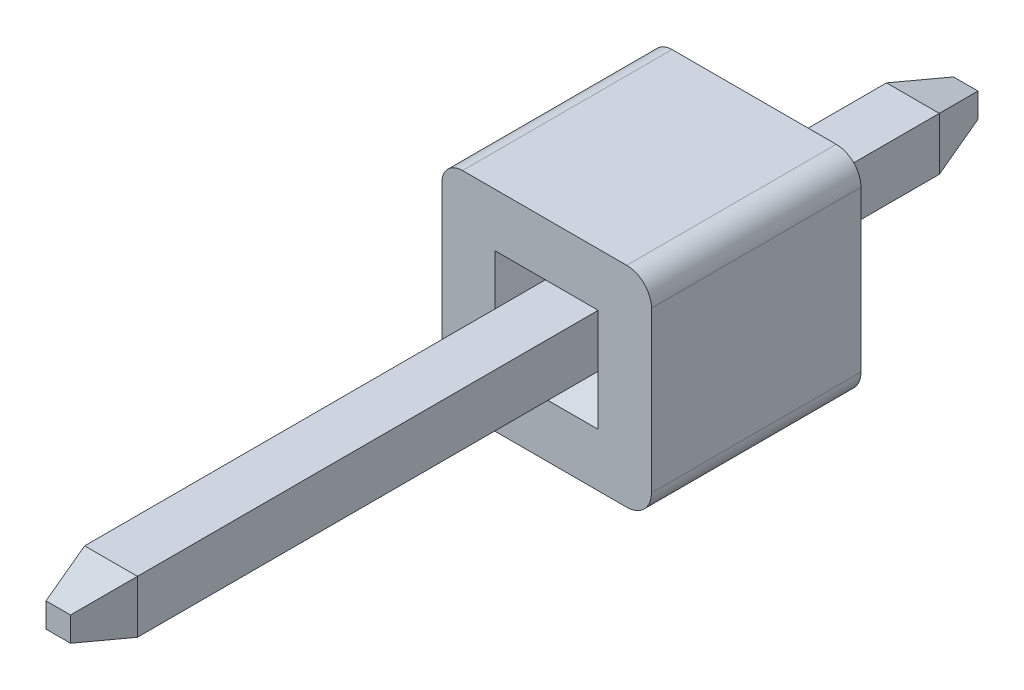
ISO-10303-21;
HEADER;
FILE_DESCRIPTION(('STEP AP214'),'2;1');
FILE_NAME('part.step','',(''),(''),'','','');
FILE_SCHEMA(('AUTOMOTIVE_DESIGN { 1 0 10303 214 1 1 1 1 }'));
ENDSEC;
DATA;
#1=APPLICATION_CONTEXT('core data for automotive mechanical design processes');
#2=APPLICATION_PROTOCOL_DEFINITION('international standard','automotive_design',2000,#1);
#3=PRODUCT_CONTEXT('',#1,'mechanical');
#4=PRODUCT('Part','Part','',(#3));
#5=PRODUCT_RELATED_PRODUCT_CATEGORY('part','',(#4));
#6=PRODUCT_DEFINITION_FORMATION('','',#4);
#7=PRODUCT_DEFINITION_CONTEXT('part definition',#1,'design');
#8=PRODUCT_DEFINITION('design','',#6,#7);
#9=PRODUCT_DEFINITION_SHAPE('','',#8);
#10=(LENGTH_UNIT() NAMED_UNIT(*) SI_UNIT(.MILLI.,.METRE.));
#11=(NAMED_UNIT(*) PLANE_ANGLE_UNIT() SI_UNIT($,.RADIAN.));
#12=(NAMED_UNIT(*) SI_UNIT($,.STERADIAN.) SOLID_ANGLE_UNIT());
#13=UNCERTAINTY_MEASURE_WITH_UNIT(LENGTH_MEASURE(1.E-05),#10,'distance_accuracy_value','');
#14=(GEOMETRIC_REPRESENTATION_CONTEXT(3) GLOBAL_UNCERTAINTY_ASSIGNED_CONTEXT((#13)) GLOBAL_UNIT_ASSIGNED_CONTEXT((#10,
#11,#12)) REPRESENTATION_CONTEXT('',''));
#15=CARTESIAN_POINT('',(0.,0.,0.));
#16=DIRECTION('',(0.,0.,1.));
#17=DIRECTION('',(1.,0.,0.));
#18=AXIS2_PLACEMENT_3D('',#15,#16,#17);
#19=CARTESIAN_POINT('',(93.9921877015739,166.440791815583,-2.54));
#20=DIRECTION('',(0.,1.,0.));
#21=DIRECTION('',(-1.,0.,0.));
#22=AXIS2_PLACEMENT_3D('',#19,#20,#21);
#23=PLANE('',#22);
#24=DIRECTION('',(-1.,0.,0.));
#25=VECTOR('',#24,1.);
#26=CARTESIAN_POINT('',(93.9921877015741,166.440791815583,0.3));
#27=LINE('',#26,#25);
#28=CARTESIAN_POINT('',(94.3171877015739,166.440791815583,0.3));
#29=VERTEX_POINT('',#28);
#30=CARTESIAN_POINT('',(93.6671877015739,166.440791815583,0.3));
#31=VERTEX_POINT('',#30);
#32=EDGE_CURVE('P0_E204',#29,#31,#27,.T.);
#33=ORIENTED_EDGE('',*,*,#32,.F.);
#34=DIRECTION('',(0.,0.,1.));
#35=VECTOR('',#34,1.);
#36=CARTESIAN_POINT('',(94.3171877015739,166.440791815583,-2.54));
#37=LINE('',#36,#35);
#38=CARTESIAN_POINT('',(94.3171877015739,166.440791815583,2.24));
#39=VERTEX_POINT('',#38);
#40=EDGE_CURVE('P0_E237',#29,#39,#37,.T.);
#41=ORIENTED_EDGE('',*,*,#40,.T.);
#42=DIRECTION('',(1.,0.,0.));
#43=VECTOR('',#42,1.);
#44=CARTESIAN_POINT('',(93.9921877015741,166.440791815583,2.24));
#45=LINE('',#44,#43);
#46=CARTESIAN_POINT('',(93.6671877015739,166.440791815583,2.24));
#47=VERTEX_POINT('',#46);
#48=EDGE_CURVE('P0_E27',#47,#39,#45,.T.);
#49=ORIENTED_EDGE('',*,*,#48,.F.);
#50=DIRECTION('',(0.,0.,1.));
#51=VECTOR('',#50,1.);
#52=CARTESIAN_POINT('',(93.6671877015739,166.440791815583,-2.54));
#53=LINE('',#52,#51);
#54=EDGE_CURVE('P0_E175',#31,#47,#53,.T.);
#55=ORIENTED_EDGE('',*,*,#54,.F.);
#56=EDGE_LOOP('',(#33,#41,#49,#55));
#57=FACE_BOUND('',#56,.T.);
#58=ADVANCED_FACE('P0_F17',(#57),#23,.F.);
#59=CARTESIAN_POINT('',(94.4671877015739,166.115791815583,2.39));
#60=DIRECTION('',(-0.707106781186548,0.,0.707106781186548));
#61=DIRECTION('',(0.707106781186548,0.,0.707106781186548));
#62=AXIS2_PLACEMENT_3D('',#59,#60,#61);
#63=PLANE('',#62);
#64=DIRECTION('',(0.,1.,0.));
#65=VECTOR('',#64,1.);
#66=CARTESIAN_POINT('',(94.6171877015739,166.115791815583,2.54));
#67=LINE('',#66,#65);
#68=CARTESIAN_POINT('',(94.6171877015739,165.490791815584,2.54));
#69=VERTEX_POINT('',#68);
#70=CARTESIAN_POINT('',(94.6171877015739,166.740791815584,2.54));
#71=VERTEX_POINT('',#70);
#72=EDGE_CURVE('P0_E200',#69,#71,#67,.T.);
#73=ORIENTED_EDGE('',*,*,#72,.T.);
#74=DIRECTION('',(0.577350269189626,0.577350269189626,0.577350269189626));
#75=VECTOR('',#74,1.);
#76=CARTESIAN_POINT('',(94.3171877015739,166.440791815583,2.24));
#77=LINE('',#76,#75);
#78=EDGE_CURVE('P0_E11',#39,#71,#77,.T.);
#79=ORIENTED_EDGE('',*,*,#78,.F.);
#80=DIRECTION('',(0.,-1.,0.));
#81=VECTOR('',#80,1.);
#82=CARTESIAN_POINT('',(94.3171877015739,166.115791815583,2.24));
#83=LINE('',#82,#81);
#84=CARTESIAN_POINT('',(94.3171877015739,165.790791815584,2.24));
#85=VERTEX_POINT('',#84);
#86=EDGE_CURVE('P0_E235',#39,#85,#83,.T.);
#87=ORIENTED_EDGE('',*,*,#86,.T.);
#88=DIRECTION('',(-0.577350269189626,0.577350269189626,-0.577350269189626));
#89=VECTOR('',#88,1.);
#90=CARTESIAN_POINT('',(94.6171877015739,165.490791815584,2.54));
#91=LINE('',#90,#89);
#92=EDGE_CURVE('P0_E223',#69,#85,#91,.T.);
#93=ORIENTED_EDGE('',*,*,#92,.F.);
#94=EDGE_LOOP('',(#73,#79,#87,#93));
#95=FACE_BOUND('',#94,.T.);
#96=ADVANCED_FACE('P0_F302',(#95),#63,.T.);
#97=CARTESIAN_POINT('',(93.9921877015741,166.590791815584,2.39));
#98=DIRECTION('',(0.,-0.707106781186548,0.707106781186548));
#99=DIRECTION('',(1.,0.,0.));
#100=AXIS2_PLACEMENT_3D('',#97,#98,#99);
#101=PLANE('',#100);
#102=DIRECTION('',(-1.,0.,0.));
#103=VECTOR('',#102,1.);
#104=CARTESIAN_POINT('',(93.9921877015741,166.740791815584,2.54));
#105=LINE('',#104,#103);
#106=CARTESIAN_POINT('',(93.3671877015739,166.740791815584,2.54));
#107=VERTEX_POINT('',#106);
#108=EDGE_CURVE('P0_E197',#71,#107,#105,.T.);
#109=ORIENTED_EDGE('',*,*,#108,.T.);
#110=DIRECTION('',(-0.577350269189626,0.577350269189626,0.577350269189626));
#111=VECTOR('',#110,1.);
#112=CARTESIAN_POINT('',(93.6671877015739,166.440791815583,2.24));
#113=LINE('',#112,#111);
#114=EDGE_CURVE('P0_E169',#47,#107,#113,.T.);
#115=ORIENTED_EDGE('',*,*,#114,.F.);
#116=ORIENTED_EDGE('',*,*,#48,.T.);
#117=ORIENTED_EDGE('',*,*,#78,.T.);
#118=EDGE_LOOP('',(#109,#115,#116,#117));
#119=FACE_BOUND('',#118,.T.);
#120=ADVANCED_FACE('P0_F366',(#119),#101,.T.);
#121=CARTESIAN_POINT('',(93.517187701574,166.115791815583,2.39));
#122=DIRECTION('',(0.707106781186548,0.,0.707106781186548));
#123=DIRECTION('',(0.707106781186548,0.,-0.707106781186548));
#124=AXIS2_PLACEMENT_3D('',#121,#122,#123);
#125=PLANE('',#124);
#126=DIRECTION('',(0.,-1.,0.));
#127=VECTOR('',#126,1.);
#128=CARTESIAN_POINT('',(93.3671877015739,166.115791815583,2.54));
#129=LINE('',#128,#127);
#130=CARTESIAN_POINT('',(93.3671877015739,165.490791815584,2.54));
#131=VERTEX_POINT('',#130);
#132=EDGE_CURVE('P0_E201',#107,#131,#129,.T.);
#133=ORIENTED_EDGE('',*,*,#132,.T.);
#134=DIRECTION('',(-0.577350269189626,-0.577350269189626,0.577350269189626));
#135=VECTOR('',#134,1.);
#136=CARTESIAN_POINT('',(93.6671877015739,165.790791815584,2.24));
#137=LINE('',#136,#135);
#138=CARTESIAN_POINT('',(93.7404110062773,165.864015120287,2.16677669529663));
#139=VERTEX_POINT('',#138);
#140=EDGE_CURVE('P0_E222',#139,#131,#137,.T.);
#141=ORIENTED_EDGE('',*,*,#140,.F.);
#142=CARTESIAN_POINT('',(93.9171877015739,166.040791815584,1.99));
#143=DIRECTION('',(0.707106781186548,0.,0.707106781186548));
#144=DIRECTION('',(-0.707106781186548,0.,0.707106781186548));
#145=AXIS2_PLACEMENT_3D('',#142,#143,#144);
#146=ELLIPSE('',#145,0.353553390593274,0.25);
#147=CARTESIAN_POINT('',(93.6671877015739,166.040791815584,2.24));
#148=VERTEX_POINT('',#147);
#149=EDGE_CURVE('P0_E218',#148,#139,#146,.T.);
#150=ORIENTED_EDGE('',*,*,#149,.F.);
#151=DIRECTION('',(0.,1.,0.));
#152=VECTOR('',#151,1.);
#153=CARTESIAN_POINT('',(93.6671877015739,166.115791815583,2.24));
#154=LINE('',#153,#152);
#155=EDGE_CURVE('P0_E183',#148,#47,#154,.T.);
#156=ORIENTED_EDGE('',*,*,#155,.T.);
#157=ORIENTED_EDGE('',*,*,#114,.T.);
#158=EDGE_LOOP('',(#133,#141,#150,#156,#157));
#159=FACE_BOUND('',#158,.T.);
#160=ADVANCED_FACE('P0_F371',(#159),#125,.T.);
#161=CARTESIAN_POINT('',(93.9921877015741,165.640791815583,2.39));
#162=DIRECTION('',(0.,0.707106781186548,0.707106781186548));
#163=DIRECTION('',(1.,0.,0.));
#164=AXIS2_PLACEMENT_3D('',#161,#162,#163);
#165=PLANE('',#164);
#166=DIRECTION('',(1.,0.,0.));
#167=VECTOR('',#166,1.);
#168=CARTESIAN_POINT('',(93.9921877015741,165.490791815584,2.54));
#169=LINE('',#168,#167);
#170=EDGE_CURVE('P0_E240',#131,#69,#169,.T.);
#171=ORIENTED_EDGE('',*,*,#170,.T.);
#172=ORIENTED_EDGE('',*,*,#92,.T.);
#173=DIRECTION('',(-1.,0.,0.));
#174=VECTOR('',#173,1.);
#175=CARTESIAN_POINT('',(93.9921877015741,165.790791815584,2.24));
#176=LINE('',#175,#174);
#177=CARTESIAN_POINT('',(93.9171877015739,165.790791815584,2.24));
#178=VERTEX_POINT('',#177);
#179=EDGE_CURVE('P0_E254',#85,#178,#176,.T.);
#180=ORIENTED_EDGE('',*,*,#179,.T.);
#181=CARTESIAN_POINT('',(93.9171877015739,166.040791815584,1.99));
#182=DIRECTION('',(0.,0.707106781186548,0.707106781186548));
#183=DIRECTION('',(0.,-0.707106781186548,0.707106781186548));
#184=AXIS2_PLACEMENT_3D('',#181,#182,#183);
#185=ELLIPSE('',#184,0.353553390593274,0.25);
#186=EDGE_CURVE('P0_E231',#139,#178,#185,.T.);
#187=ORIENTED_EDGE('',*,*,#186,.F.);
#188=ORIENTED_EDGE('',*,*,#140,.T.);
#189=EDGE_LOOP('',(#171,#172,#180,#187,#188));
#190=FACE_BOUND('',#189,.T.);
#191=ADVANCED_FACE('P0_F292',(#190),#165,.T.);
#192=CARTESIAN_POINT('',(93.9921877015739,165.790791815584,-2.54));
#193=DIRECTION('',(0.,-1.,0.));
#194=DIRECTION('',(1.,0.,0.));
#195=AXIS2_PLACEMENT_3D('',#192,#193,#194);
#196=PLANE('',#195);
#197=DIRECTION('',(0.,0.,-1.));
#198=VECTOR('',#197,1.);
#199=CARTESIAN_POINT('',(93.9171877015739,165.790791815584,-2.54));
#200=LINE('',#199,#198);
#201=CARTESIAN_POINT('',(93.9171877015739,165.790791815584,0.3));
#202=VERTEX_POINT('',#201);
#203=EDGE_CURVE('P0_E234',#178,#202,#200,.T.);
#204=ORIENTED_EDGE('',*,*,#203,.F.);
#205=ORIENTED_EDGE('',*,*,#179,.F.);
#206=DIRECTION('',(0.,0.,1.));
#207=VECTOR('',#206,1.);
#208=CARTESIAN_POINT('',(94.3171877015739,165.790791815584,-2.54));
#209=LINE('',#208,#207);
#210=CARTESIAN_POINT('',(94.3171877015739,165.790791815584,0.3));
#211=VERTEX_POINT('',#210);
#212=EDGE_CURVE('P0_E154',#211,#85,#209,.T.);
#213=ORIENTED_EDGE('',*,*,#212,.F.);
#214=DIRECTION('',(1.,0.,0.));
#215=VECTOR('',#214,1.);
#216=CARTESIAN_POINT('',(93.9921877015741,165.790791815584,0.3));
#217=LINE('',#216,#215);
#218=EDGE_CURVE('P0_E215',#202,#211,#217,.T.);
#219=ORIENTED_EDGE('',*,*,#218,.F.);
#220=EDGE_LOOP('',(#204,#205,#213,#219));
#221=FACE_BOUND('',#220,.T.);
#222=ADVANCED_FACE('P0_F298',(#221),#196,.F.);
#223=CARTESIAN_POINT('',(94.3171877015739,166.115791815583,-2.54));
#224=DIRECTION('',(1.,0.,0.));
#225=DIRECTION('',(0.,1.,0.));
#226=AXIS2_PLACEMENT_3D('',#223,#224,#225);
#227=PLANE('',#226);
#228=DIRECTION('',(0.,1.,0.));
#229=VECTOR('',#228,1.);
#230=CARTESIAN_POINT('',(94.3171877015739,166.115791815583,0.3));
#231=LINE('',#230,#229);
#232=EDGE_CURVE('P0_E206',#211,#29,#231,.T.);
#233=ORIENTED_EDGE('',*,*,#232,.F.);
#234=ORIENTED_EDGE('',*,*,#212,.T.);
#235=ORIENTED_EDGE('',*,*,#86,.F.);
#236=ORIENTED_EDGE('',*,*,#40,.F.);
#237=EDGE_LOOP('',(#233,#234,#235,#236));
#238=FACE_BOUND('',#237,.T.);
#239=ADVANCED_FACE('P0_F304',(#238),#227,.F.);
#240=CARTESIAN_POINT('',(94.4671877015739,166.115791815583,0.15));
#241=DIRECTION('',(-0.707106781186548,0.,-0.707106781186547));
#242=DIRECTION('',(-0.707106781186547,0.,0.707106781186548));
#243=AXIS2_PLACEMENT_3D('',#240,#241,#242);
#244=PLANE('',#243);
#245=DIRECTION('',(0.,-1.,0.));
#246=VECTOR('',#245,1.);
#247=CARTESIAN_POINT('',(94.6171877015739,166.115791815583,0.));
#248=LINE('',#247,#246);
#249=CARTESIAN_POINT('',(94.6171877015739,166.740791815584,0.));
#250=VERTEX_POINT('',#249);
#251=CARTESIAN_POINT('',(94.6171877015739,165.490791815584,0.));
#252=VERTEX_POINT('',#251);
#253=EDGE_CURVE('P0_E173',#250,#252,#248,.T.);
#254=ORIENTED_EDGE('',*,*,#253,.T.);
#255=DIRECTION('',(0.577350269189625,-0.577350269189625,-0.577350269189626));
#256=VECTOR('',#255,1.);
#257=CARTESIAN_POINT('',(94.3171877015739,165.790791815584,0.3));
#258=LINE('',#257,#256);
#259=EDGE_CURVE('P0_E211',#211,#252,#258,.T.);
#260=ORIENTED_EDGE('',*,*,#259,.F.);
#261=ORIENTED_EDGE('',*,*,#232,.T.);
#262=DIRECTION('',(-0.577350269189625,-0.577350269189625,0.577350269189626));
#263=VECTOR('',#262,1.);
#264=CARTESIAN_POINT('',(94.6171877015739,166.740791815584,0.));
#265=LINE('',#264,#263);
#266=EDGE_CURVE('P0_E207',#250,#29,#265,.T.);
#267=ORIENTED_EDGE('',*,*,#266,.F.);
#268=EDGE_LOOP('',(#254,#260,#261,#267));
#269=FACE_BOUND('',#268,.T.);
#270=ADVANCED_FACE('P0_F308',(#269),#244,.T.);
#271=CARTESIAN_POINT('',(93.9921877015741,166.590791815584,0.15));
#272=DIRECTION('',(0.,-0.707106781186548,-0.707106781186547));
#273=DIRECTION('',(-1.,0.,0.));
#274=AXIS2_PLACEMENT_3D('',#271,#272,#273);
#275=PLANE('',#274);
#276=DIRECTION('',(1.,0.,0.));
#277=VECTOR('',#276,1.);
#278=CARTESIAN_POINT('',(93.9921877015741,166.740791815584,0.));
#279=LINE('',#278,#277);
#280=CARTESIAN_POINT('',(93.3671877015739,166.740791815584,0.));
#281=VERTEX_POINT('',#280);
#282=EDGE_CURVE('P0_E170',#281,#250,#279,.T.);
#283=ORIENTED_EDGE('',*,*,#282,.T.);
#284=ORIENTED_EDGE('',*,*,#266,.T.);
#285=ORIENTED_EDGE('',*,*,#32,.T.);
#286=DIRECTION('',(0.577350269189625,-0.577350269189625,0.577350269189626));
#287=VECTOR('',#286,1.);
#288=CARTESIAN_POINT('',(93.3671877015739,166.740791815584,0.));
#289=LINE('',#288,#287);
#290=EDGE_CURVE('P0_E214',#281,#31,#289,.T.);
#291=ORIENTED_EDGE('',*,*,#290,.F.);
#292=EDGE_LOOP('',(#283,#284,#285,#291));
#293=FACE_BOUND('',#292,.T.);
#294=ADVANCED_FACE('P0_F384',(#293),#275,.T.);
#295=CARTESIAN_POINT('',(93.517187701574,166.115791815583,0.15));
#296=DIRECTION('',(0.707106781186548,0.,-0.707106781186547));
#297=DIRECTION('',(-0.707106781186547,0.,-0.707106781186548));
#298=AXIS2_PLACEMENT_3D('',#295,#296,#297);
#299=PLANE('',#298);
#300=DIRECTION('',(0.,1.,0.));
#301=VECTOR('',#300,1.);
#302=CARTESIAN_POINT('',(93.3671877015739,166.115791815583,0.));
#303=LINE('',#302,#301);
#304=CARTESIAN_POINT('',(93.3671877015739,165.490791815584,0.));
#305=VERTEX_POINT('',#304);
#306=EDGE_CURVE('P0_E172',#305,#281,#303,.T.);
#307=ORIENTED_EDGE('',*,*,#306,.T.);
#308=ORIENTED_EDGE('',*,*,#290,.T.);
#309=DIRECTION('',(0.,-1.,0.));
#310=VECTOR('',#309,1.);
#311=CARTESIAN_POINT('',(93.6671877015739,166.115791815583,0.3));
#312=LINE('',#311,#310);
#313=CARTESIAN_POINT('',(93.6671877015739,166.040791815584,0.3));
#314=VERTEX_POINT('',#313);
#315=EDGE_CURVE('P0_E174',#31,#314,#312,.T.);
#316=ORIENTED_EDGE('',*,*,#315,.T.);
#317=CARTESIAN_POINT('',(93.9171877015739,166.040791815584,0.55));
#318=DIRECTION('',(-0.707106781186548,0.,0.707106781186547));
#319=DIRECTION('',(-0.707106781186547,0.,-0.707106781186548));
#320=AXIS2_PLACEMENT_3D('',#317,#318,#319);
#321=ELLIPSE('',#320,0.353553390593274,0.25);
#322=CARTESIAN_POINT('',(93.7404110062773,165.864015120287,0.373223304703363));
#323=VERTEX_POINT('',#322);
#324=EDGE_CURVE('P0_E186',#314,#323,#321,.T.);
#325=ORIENTED_EDGE('',*,*,#324,.T.);
#326=DIRECTION('',(0.577350269189625,0.577350269189625,0.577350269189626));
#327=VECTOR('',#326,1.);
#328=CARTESIAN_POINT('',(93.3671877015739,165.490791815584,0.));
#329=LINE('',#328,#327);
#330=EDGE_CURVE('P0_E210',#305,#323,#329,.T.);
#331=ORIENTED_EDGE('',*,*,#330,.F.);
#332=EDGE_LOOP('',(#307,#308,#316,#325,#331));
#333=FACE_BOUND('',#332,.T.);
#334=ADVANCED_FACE('P0_F357',(#333),#299,.T.);
#335=CARTESIAN_POINT('',(93.9921877015741,165.640791815583,0.15));
#336=DIRECTION('',(0.,0.707106781186548,-0.707106781186547));
#337=DIRECTION('',(-1.,0.,0.));
#338=AXIS2_PLACEMENT_3D('',#335,#336,#337);
#339=PLANE('',#338);
#340=DIRECTION('',(-1.,0.,0.));
#341=VECTOR('',#340,1.);
#342=CARTESIAN_POINT('',(93.9921877015741,165.490791815584,0.));
#343=LINE('',#342,#341);
#344=EDGE_CURVE('P0_E157',#252,#305,#343,.T.);
#345=ORIENTED_EDGE('',*,*,#344,.T.);
#346=ORIENTED_EDGE('',*,*,#330,.T.);
#347=CARTESIAN_POINT('',(93.9171877015739,166.040791815584,0.55));
#348=DIRECTION('',(0.,-0.707106781186548,0.707106781186547));
#349=DIRECTION('',(0.,-0.707106781186547,-0.707106781186548));
#350=AXIS2_PLACEMENT_3D('',#347,#348,#349);
#351=ELLIPSE('',#350,0.353553390593274,0.25);
#352=EDGE_CURVE('P0_E192',#323,#202,#351,.T.);
#353=ORIENTED_EDGE('',*,*,#352,.T.);
#354=ORIENTED_EDGE('',*,*,#218,.T.);
#355=ORIENTED_EDGE('',*,*,#259,.T.);
#356=EDGE_LOOP('',(#345,#346,#353,#354,#355));
#357=FACE_BOUND('',#356,.T.);
#358=ADVANCED_FACE('P0_F312',(#357),#339,.T.);
#359=CARTESIAN_POINT('',(92.9721877015742,167.135791815584,0.));
#360=DIRECTION('',(0.,0.,-1.));
#361=DIRECTION('',(-0.707106781186548,0.707106781186548,0.));
#362=AXIS2_PLACEMENT_3D('',#359,#360,#361);
#363=CYLINDRICAL_SURFACE('',#362,0.25);
#364=CARTESIAN_POINT('',(92.9721877015742,167.135791815584,2.54));
#365=DIRECTION('',(0.,0.,-1.));
#366=DIRECTION('',(-0.707106781186548,0.707106781186548,0.));
#367=AXIS2_PLACEMENT_3D('',#364,#365,#366);
#368=CIRCLE('',#367,0.25);
#369=CARTESIAN_POINT('',(92.7221877015742,167.135791815584,2.54));
#370=VERTEX_POINT('',#369);
#371=CARTESIAN_POINT('',(92.9721877015742,167.385791815584,2.54));
#372=VERTEX_POINT('',#371);
#373=EDGE_CURVE('P0_E21',#370,#372,#368,.T.);
#374=ORIENTED_EDGE('',*,*,#373,.T.);
#375=DIRECTION('',(0.,0.,-1.));
#376=VECTOR('',#375,1.);
#377=CARTESIAN_POINT('',(92.9721877015742,167.385791815584,0.));
#378=LINE('',#377,#376);
#379=CARTESIAN_POINT('',(92.9721877015742,167.385791815584,0.));
#380=VERTEX_POINT('',#379);
#381=EDGE_CURVE('P0_E216',#372,#380,#378,.T.);
#382=ORIENTED_EDGE('',*,*,#381,.T.);
#383=CARTESIAN_POINT('',(92.9721877015742,167.135791815584,0.));
#384=DIRECTION('',(0.,0.,1.));
#385=DIRECTION('',(-0.707106781186548,0.707106781186548,0.));
#386=AXIS2_PLACEMENT_3D('',#383,#384,#385);
#387=CIRCLE('',#386,0.25);
#388=CARTESIAN_POINT('',(92.7221877015742,167.135791815584,0.));
#389=VERTEX_POINT('',#388);
#390=EDGE_CURVE('P0_E163',#380,#389,#387,.T.);
#391=ORIENTED_EDGE('',*,*,#390,.T.);
#392=DIRECTION('',(0.,0.,1.));
#393=VECTOR('',#392,1.);
#394=CARTESIAN_POINT('',(92.7221877015742,167.135791815584,0.));
#395=LINE('',#394,#393);
#396=EDGE_CURVE('P0_E219',#389,#370,#395,.T.);
#397=ORIENTED_EDGE('',*,*,#396,.T.);
#398=EDGE_LOOP('',(#374,#382,#391,#397));
#399=FACE_BOUND('',#398,.T.);
#400=ADVANCED_FACE('P0_F346',(#399),#363,.T.);
#401=CARTESIAN_POINT('',(93.6671877015739,166.115791815583,-2.54));
#402=DIRECTION('',(-1.,0.,0.));
#403=DIRECTION('',(0.,-1.,0.));
#404=AXIS2_PLACEMENT_3D('',#401,#402,#403);
#405=PLANE('',#404);
#406=DIRECTION('',(0.,0.,1.));
#407=VECTOR('',#406,1.);
#408=CARTESIAN_POINT('',(93.6671877015739,166.040791815584,-2.54));
#409=LINE('',#408,#407);
#410=EDGE_CURVE('P0_E176',#314,#148,#409,.T.);
#411=ORIENTED_EDGE('',*,*,#410,.F.);
#412=ORIENTED_EDGE('',*,*,#315,.F.);
#413=ORIENTED_EDGE('',*,*,#54,.T.);
#414=ORIENTED_EDGE('',*,*,#155,.F.);
#415=EDGE_LOOP('',(#411,#412,#413,#414));
#416=FACE_BOUND('',#415,.T.);
#417=ADVANCED_FACE('P0_F348',(#416),#405,.F.);
#418=CARTESIAN_POINT('',(93.9171877015739,166.040791815584,-2.54));
#419=DIRECTION('',(0.,0.,-1.));
#420=DIRECTION('',(-0.707106781186548,-0.707106781186548,0.));
#421=AXIS2_PLACEMENT_3D('',#418,#419,#420);
#422=CYLINDRICAL_SURFACE('',#421,0.25);
#423=ORIENTED_EDGE('',*,*,#149,.T.);
#424=ORIENTED_EDGE('',*,*,#186,.T.);
#425=ORIENTED_EDGE('',*,*,#203,.T.);
#426=ORIENTED_EDGE('',*,*,#352,.F.);
#427=ORIENTED_EDGE('',*,*,#324,.F.);
#428=ORIENTED_EDGE('',*,*,#410,.T.);
#429=EDGE_LOOP('',(#423,#424,#425,#426,#427,#428));
#430=FACE_BOUND('',#429,.T.);
#431=ADVANCED_FACE('P0_F315',(#430),#422,.F.);
#432=CARTESIAN_POINT('',(93.9921877015742,167.385791815584,0.));
#433=DIRECTION('',(0.,1.,0.));
#434=DIRECTION('',(-1.,0.,0.));
#435=AXIS2_PLACEMENT_3D('',#432,#433,#434);
#436=PLANE('',#435);
#437=DIRECTION('',(0.,0.,1.));
#438=VECTOR('',#437,1.);
#439=CARTESIAN_POINT('',(94.9621877015742,167.385791815584,0.));
#440=LINE('',#439,#438);
#441=CARTESIAN_POINT('',(94.9621877015742,167.385791815584,0.));
#442=VERTEX_POINT('',#441);
#443=CARTESIAN_POINT('',(94.9621877015742,167.385791815584,2.54));
#444=VERTEX_POINT('',#443);
#445=EDGE_CURVE('P0_E220',#442,#444,#440,.T.);
#446=ORIENTED_EDGE('',*,*,#445,.F.);
#447=DIRECTION('',(-1.,0.,0.));
#448=VECTOR('',#447,1.);
#449=CARTESIAN_POINT('',(95.2621877015742,167.385791815584,0.));
#450=LINE('',#449,#448);
#451=EDGE_CURVE('P0_E165',#442,#380,#450,.T.);
#452=ORIENTED_EDGE('',*,*,#451,.T.);
#453=ORIENTED_EDGE('',*,*,#381,.F.);
#454=DIRECTION('',(1.,0.,0.));
#455=VECTOR('',#454,1.);
#456=CARTESIAN_POINT('',(95.2621877015742,167.385791815584,2.54));
#457=LINE('',#456,#455);
#458=EDGE_CURVE('P0_E257',#372,#444,#457,.T.);
#459=ORIENTED_EDGE('',*,*,#458,.T.);
#460=EDGE_LOOP('',(#446,#452,#453,#459));
#461=FACE_BOUND('',#460,.T.);
#462=ADVANCED_FACE('P0_F344',(#461),#436,.T.);
#463=CARTESIAN_POINT('',(92.7221877015742,166.115791815583,0.));
#464=DIRECTION('',(-1.,0.,0.));
#465=DIRECTION('',(0.,-1.,0.));
#466=AXIS2_PLACEMENT_3D('',#463,#464,#465);
#467=PLANE('',#466);
#468=DIRECTION('',(0.,0.,-1.));
#469=VECTOR('',#468,1.);
#470=CARTESIAN_POINT('',(92.7221877015742,165.145791815583,0.));
#471=LINE('',#470,#469);
#472=CARTESIAN_POINT('',(92.7221877015742,165.145791815583,2.54));
#473=VERTEX_POINT('',#472);
#474=CARTESIAN_POINT('',(92.7221877015742,165.145791815583,0.));
#475=VERTEX_POINT('',#474);
#476=EDGE_CURVE('P0_E246',#473,#475,#471,.T.);
#477=ORIENTED_EDGE('',*,*,#476,.F.);
#478=DIRECTION('',(0.,1.,0.));
#479=VECTOR('',#478,1.);
#480=CARTESIAN_POINT('',(92.7221877015742,167.385791815584,2.54));
#481=LINE('',#480,#479);
#482=EDGE_CURVE('P0_E264',#473,#370,#481,.T.);
#483=ORIENTED_EDGE('',*,*,#482,.T.);
#484=ORIENTED_EDGE('',*,*,#396,.F.);
#485=DIRECTION('',(0.,-1.,0.));
#486=VECTOR('',#485,1.);
#487=CARTESIAN_POINT('',(92.7221877015742,167.385791815584,0.));
#488=LINE('',#487,#486);
#489=EDGE_CURVE('P0_E166',#389,#475,#488,.T.);
#490=ORIENTED_EDGE('',*,*,#489,.T.);
#491=EDGE_LOOP('',(#477,#483,#484,#490));
#492=FACE_BOUND('',#491,.T.);
#493=ADVANCED_FACE('P0_F335',(#492),#467,.T.);
#494=CARTESIAN_POINT('',(94.9621877015742,167.085791815583,0.));
#495=DIRECTION('',(0.,0.,-1.));
#496=DIRECTION('',(0.707106781186548,0.707106781186548,0.));
#497=AXIS2_PLACEMENT_3D('',#494,#495,#496);
#498=CYLINDRICAL_SURFACE('',#497,0.3);
#499=CARTESIAN_POINT('',(94.9621877015742,167.085791815583,2.54));
#500=DIRECTION('',(0.,0.,-1.));
#501=DIRECTION('',(0.707106781186548,0.707106781186548,0.));
#502=AXIS2_PLACEMENT_3D('',#499,#500,#501);
#503=CIRCLE('',#502,0.3);
#504=CARTESIAN_POINT('',(95.2621877015742,167.085791815583,2.54));
#505=VERTEX_POINT('',#504);
#506=EDGE_CURVE('P0_E134',#444,#505,#503,.T.);
#507=ORIENTED_EDGE('',*,*,#506,.T.);
#508=DIRECTION('',(0.,0.,-1.));
#509=VECTOR('',#508,1.);
#510=CARTESIAN_POINT('',(95.2621877015742,167.085791815583,0.));
#511=LINE('',#510,#509);
#512=CARTESIAN_POINT('',(95.2621877015742,167.085791815583,0.));
#513=VERTEX_POINT('',#512);
#514=EDGE_CURVE('P0_E129',#505,#513,#511,.T.);
#515=ORIENTED_EDGE('',*,*,#514,.T.);
#516=CARTESIAN_POINT('',(94.9621877015742,167.085791815583,0.));
#517=DIRECTION('',(0.,0.,1.));
#518=DIRECTION('',(0.707106781186548,0.707106781186548,0.));
#519=AXIS2_PLACEMENT_3D('',#516,#517,#518);
#520=CIRCLE('',#519,0.3);
#521=EDGE_CURVE('P0_E229',#513,#442,#520,.T.);
#522=ORIENTED_EDGE('',*,*,#521,.T.);
#523=ORIENTED_EDGE('',*,*,#445,.T.);
#524=EDGE_LOOP('',(#507,#515,#522,#523));
#525=FACE_BOUND('',#524,.T.);
#526=ADVANCED_FACE('P0_F343',(#525),#498,.T.);
#527=CARTESIAN_POINT('',(95.2621877015742,166.115791815583,0.));
#528=DIRECTION('',(1.,0.,0.));
#529=DIRECTION('',(0.,1.,0.));
#530=AXIS2_PLACEMENT_3D('',#527,#528,#529);
#531=PLANE('',#530);
#532=DIRECTION('',(0.,0.,1.));
#533=VECTOR('',#532,1.);
#534=CARTESIAN_POINT('',(95.2621877015742,165.145791815583,0.));
#535=LINE('',#534,#533);
#536=CARTESIAN_POINT('',(95.2621877015742,165.145791815583,0.));
#537=VERTEX_POINT('',#536);
#538=CARTESIAN_POINT('',(95.2621877015742,165.145791815583,2.54));
#539=VERTEX_POINT('',#538);
#540=EDGE_CURVE('P0_E126',#537,#539,#535,.T.);
#541=ORIENTED_EDGE('',*,*,#540,.F.);
#542=DIRECTION('',(0.,1.,0.));
#543=VECTOR('',#542,1.);
#544=CARTESIAN_POINT('',(95.2621877015742,164.845791815584,0.));
#545=LINE('',#544,#543);
#546=EDGE_CURVE('P0_E150',#537,#513,#545,.T.);
#547=ORIENTED_EDGE('',*,*,#546,.T.);
#548=ORIENTED_EDGE('',*,*,#514,.F.);
#549=DIRECTION('',(0.,-1.,0.));
#550=VECTOR('',#549,1.);
#551=CARTESIAN_POINT('',(95.2621877015742,164.845791815584,2.54));
#552=LINE('',#551,#550);
#553=EDGE_CURVE('P0_E122',#505,#539,#552,.T.);
#554=ORIENTED_EDGE('',*,*,#553,.T.);
#555=EDGE_LOOP('',(#541,#547,#548,#554));
#556=FACE_BOUND('',#555,.T.);
#557=ADVANCED_FACE('P0_F124',(#556),#531,.T.);
#558=CARTESIAN_POINT('',(93.9921877015742,166.115791815583,2.54));
#559=DIRECTION('',(0.,0.,1.));
#560=DIRECTION('',(1.,0.,0.));
#561=AXIS2_PLACEMENT_3D('',#558,#559,#560);
#562=PLANE('',#561);
#563=ORIENTED_EDGE('',*,*,#170,.F.);
#564=ORIENTED_EDGE('',*,*,#132,.F.);
#565=ORIENTED_EDGE('',*,*,#108,.F.);
#566=ORIENTED_EDGE('',*,*,#72,.F.);
#567=EDGE_LOOP('',(#563,#564,#565,#566));
#568=FACE_BOUND('',#567,.T.);
#569=CARTESIAN_POINT('',(93.0221877015742,165.145791815583,2.54));
#570=DIRECTION('',(0.,0.,-1.));
#571=DIRECTION('',(-0.707106781186548,-0.707106781186548,0.));
#572=AXIS2_PLACEMENT_3D('',#569,#570,#571);
#573=CIRCLE('',#572,0.3);
#574=CARTESIAN_POINT('',(93.0221877015742,164.845791815584,2.54));
#575=VERTEX_POINT('',#574);
#576=EDGE_CURVE('P0_E243',#575,#473,#573,.T.);
#577=ORIENTED_EDGE('',*,*,#576,.F.);
#578=DIRECTION('',(-1.,0.,0.));
#579=VECTOR('',#578,1.);
#580=CARTESIAN_POINT('',(92.7221877015742,164.845791815584,2.54));
#581=LINE('',#580,#579);
#582=CARTESIAN_POINT('',(94.9621877015742,164.845791815584,2.54));
#583=VERTEX_POINT('',#582);
#584=EDGE_CURVE('P0_E147',#583,#575,#581,.T.);
#585=ORIENTED_EDGE('',*,*,#584,.F.);
#586=CARTESIAN_POINT('',(94.9621877015742,165.145791815583,2.54));
#587=DIRECTION('',(0.,0.,-1.));
#588=DIRECTION('',(0.707106781186548,-0.707106781186548,0.));
#589=AXIS2_PLACEMENT_3D('',#586,#587,#588);
#590=CIRCLE('',#589,0.3);
#591=EDGE_CURVE('P0_E139',#539,#583,#590,.T.);
#592=ORIENTED_EDGE('',*,*,#591,.F.);
#593=ORIENTED_EDGE('',*,*,#553,.F.);
#594=ORIENTED_EDGE('',*,*,#506,.F.);
#595=ORIENTED_EDGE('',*,*,#458,.F.);
#596=ORIENTED_EDGE('',*,*,#373,.F.);
#597=ORIENTED_EDGE('',*,*,#482,.F.);
#598=EDGE_LOOP('',(#577,#585,#592,#593,#594,#595,#596,#597));
#599=FACE_BOUND('',#598,.T.);
#600=ADVANCED_FACE('P0_F145',(#568,#599),#562,.T.);
#601=CARTESIAN_POINT('',(94.9621877015742,165.145791815583,0.));
#602=DIRECTION('',(0.,0.,-1.));
#603=DIRECTION('',(0.707106781186548,-0.707106781186548,0.));
#604=AXIS2_PLACEMENT_3D('',#601,#602,#603);
#605=CYLINDRICAL_SURFACE('',#604,0.3);
#606=ORIENTED_EDGE('',*,*,#591,.T.);
#607=DIRECTION('',(0.,0.,-1.));
#608=VECTOR('',#607,1.);
#609=CARTESIAN_POINT('',(94.9621877015742,164.845791815584,0.));
#610=LINE('',#609,#608);
#611=CARTESIAN_POINT('',(94.9621877015742,164.845791815584,0.));
#612=VERTEX_POINT('',#611);
#613=EDGE_CURVE('P0_E158',#583,#612,#610,.T.);
#614=ORIENTED_EDGE('',*,*,#613,.T.);
#615=CARTESIAN_POINT('',(94.9621877015742,165.145791815583,0.));
#616=DIRECTION('',(0.,0.,1.));
#617=DIRECTION('',(0.707106781186548,-0.707106781186548,0.));
#618=AXIS2_PLACEMENT_3D('',#615,#616,#617);
#619=CIRCLE('',#618,0.3);
#620=EDGE_CURVE('P0_E141',#612,#537,#619,.T.);
#621=ORIENTED_EDGE('',*,*,#620,.T.);
#622=ORIENTED_EDGE('',*,*,#540,.T.);
#623=EDGE_LOOP('',(#606,#614,#621,#622));
#624=FACE_BOUND('',#623,.T.);
#625=ADVANCED_FACE('P0_F137',(#624),#605,.T.);
#626=CARTESIAN_POINT('',(93.9921877015742,166.115791815583,0.));
#627=DIRECTION('',(0.,0.,1.));
#628=DIRECTION('',(1.,0.,0.));
#629=AXIS2_PLACEMENT_3D('',#626,#627,#628);
#630=PLANE('',#629);
#631=CARTESIAN_POINT('',(93.0221877015742,165.145791815583,0.));
#632=DIRECTION('',(0.,0.,1.));
#633=DIRECTION('',(-0.707106781186548,-0.707106781186548,0.));
#634=AXIS2_PLACEMENT_3D('',#631,#632,#633);
#635=CIRCLE('',#634,0.3);
#636=CARTESIAN_POINT('',(93.0221877015742,164.845791815584,0.));
#637=VERTEX_POINT('',#636);
#638=EDGE_CURVE('P0_E273',#475,#637,#635,.T.);
#639=ORIENTED_EDGE('',*,*,#638,.F.);
#640=ORIENTED_EDGE('',*,*,#489,.F.);
#641=ORIENTED_EDGE('',*,*,#390,.F.);
#642=ORIENTED_EDGE('',*,*,#451,.F.);
#643=ORIENTED_EDGE('',*,*,#521,.F.);
#644=ORIENTED_EDGE('',*,*,#546,.F.);
#645=ORIENTED_EDGE('',*,*,#620,.F.);
#646=DIRECTION('',(1.,0.,0.));
#647=VECTOR('',#646,1.);
#648=CARTESIAN_POINT('',(92.7221877015742,164.845791815584,0.));
#649=LINE('',#648,#647);
#650=EDGE_CURVE('P0_E159',#637,#612,#649,.T.);
#651=ORIENTED_EDGE('',*,*,#650,.F.);
#652=EDGE_LOOP('',(#639,#640,#641,#642,#643,#644,#645,#651));
#653=FACE_BOUND('',#652,.T.);
#654=ORIENTED_EDGE('',*,*,#344,.F.);
#655=ORIENTED_EDGE('',*,*,#253,.F.);
#656=ORIENTED_EDGE('',*,*,#282,.F.);
#657=ORIENTED_EDGE('',*,*,#306,.F.);
#658=EDGE_LOOP('',(#654,#655,#656,#657));
#659=FACE_BOUND('',#658,.T.);
#660=ADVANCED_FACE('P0_F339',(#653,#659),#630,.F.);
#661=CARTESIAN_POINT('',(93.9921877015742,164.845791815584,0.));
#662=DIRECTION('',(0.,-1.,0.));
#663=DIRECTION('',(1.,0.,0.));
#664=AXIS2_PLACEMENT_3D('',#661,#662,#663);
#665=PLANE('',#664);
#666=DIRECTION('',(0.,0.,1.));
#667=VECTOR('',#666,1.);
#668=CARTESIAN_POINT('',(93.0221877015742,164.845791815584,0.));
#669=LINE('',#668,#667);
#670=EDGE_CURVE('P0_E161',#637,#575,#669,.T.);
#671=ORIENTED_EDGE('',*,*,#670,.F.);
#672=ORIENTED_EDGE('',*,*,#650,.T.);
#673=ORIENTED_EDGE('',*,*,#613,.F.);
#674=ORIENTED_EDGE('',*,*,#584,.T.);
#675=EDGE_LOOP('',(#671,#672,#673,#674));
#676=FACE_BOUND('',#675,.T.);
#677=ADVANCED_FACE('P0_F19',(#676),#665,.T.);
#678=CARTESIAN_POINT('',(93.0221877015742,165.145791815583,0.));
#679=DIRECTION('',(0.,0.,-1.));
#680=DIRECTION('',(-0.707106781186548,-0.707106781186548,0.));
#681=AXIS2_PLACEMENT_3D('',#678,#679,#680);
#682=CYLINDRICAL_SURFACE('',#681,0.3);
#683=ORIENTED_EDGE('',*,*,#576,.T.);
#684=ORIENTED_EDGE('',*,*,#476,.T.);
#685=ORIENTED_EDGE('',*,*,#638,.T.);
#686=ORIENTED_EDGE('',*,*,#670,.T.);
#687=EDGE_LOOP('',(#683,#684,#685,#686));
#688=FACE_BOUND('',#687,.T.);
#689=ADVANCED_FACE('P0_F330',(#688),#682,.T.);
#690=CLOSED_SHELL('',(#58,#96,#120,#160,#191,#222,#239,#270,#294,#334,#358,#400,#417,#431,#462,
#493,#526,#557,#600,#625,#660,#677,#689));
#691=MANIFOLD_SOLID_BREP('P0_B1',#690);
#692=CARTESIAN_POINT('',(93.9921877015742,166.115791815583,-2.54));
#693=DIRECTION('',(0.,0.,1.));
#694=DIRECTION('',(1.,0.,0.));
#695=AXIS2_PLACEMENT_3D('',#692,#693,#694);
#696=PLANE('',#695);
#697=DIRECTION('',(0.,1.,0.));
#698=VECTOR('',#697,1.);
#699=CARTESIAN_POINT('',(94.1407002184183,166.115791815583,-2.54));
#700=LINE('',#699,#698);
#701=CARTESIAN_POINT('',(94.1407002184183,165.967279298739,-2.54));
#702=VERTEX_POINT('',#701);
#703=CARTESIAN_POINT('',(94.1407002184183,166.264304332428,-2.54));
#704=VERTEX_POINT('',#703);
#705=EDGE_CURVE('P1_E129',#702,#704,#700,.T.);
#706=ORIENTED_EDGE('',*,*,#705,.F.);
#707=DIRECTION('',(1.,0.,0.));
#708=VECTOR('',#707,1.);
#709=CARTESIAN_POINT('',(93.9921877015742,165.967279298739,-2.54));
#710=LINE('',#709,#708);
#711=CARTESIAN_POINT('',(93.8436751847301,165.967279298739,-2.54));
#712=VERTEX_POINT('',#711);
#713=EDGE_CURVE('P1_E27',#712,#702,#710,.T.);
#714=ORIENTED_EDGE('',*,*,#713,.F.);
#715=DIRECTION('',(0.,-1.,0.));
#716=VECTOR('',#715,1.);
#717=CARTESIAN_POINT('',(93.8436751847301,166.115791815583,-2.54));
#718=LINE('',#717,#716);
#719=CARTESIAN_POINT('',(93.8436751847301,166.264304332428,-2.54));
#720=VERTEX_POINT('',#719);
#721=EDGE_CURVE('P1_E127',#720,#712,#718,.T.);
#722=ORIENTED_EDGE('',*,*,#721,.F.);
#723=DIRECTION('',(-1.,0.,0.));
#724=VECTOR('',#723,1.);
#725=CARTESIAN_POINT('',(93.9921877015742,166.264304332428,-2.54));
#726=LINE('',#725,#724);
#727=EDGE_CURVE('P1_E128',#704,#720,#726,.T.);
#728=ORIENTED_EDGE('',*,*,#727,.F.);
#729=EDGE_LOOP('',(#706,#714,#722,#728));
#730=FACE_BOUND('',#729,.T.);
#731=ADVANCED_FACE('P1_F17',(#730),#696,.F.);
#732=CARTESIAN_POINT('',(94.3121877015742,166.115791815583,-2.54));
#733=DIRECTION('',(1.,0.,0.));
#734=DIRECTION('',(0.,1.,0.));
#735=AXIS2_PLACEMENT_3D('',#732,#733,#734);
#736=PLANE('',#735);
#737=DIRECTION('',(0.,1.,0.));
#738=VECTOR('',#737,1.);
#739=CARTESIAN_POINT('',(94.3121877015742,166.115791815583,7.82));
#740=LINE('',#739,#738);
#741=CARTESIAN_POINT('',(94.3121877015742,165.795791815584,7.82));
#742=VERTEX_POINT('',#741);
#743=CARTESIAN_POINT('',(94.3121877015742,166.435791815584,7.82));
#744=VERTEX_POINT('',#743);
#745=EDGE_CURVE('P1_E83',#742,#744,#740,.T.);
#746=ORIENTED_EDGE('',*,*,#745,.F.);
#747=DIRECTION('',(0.,0.,1.));
#748=VECTOR('',#747,1.);
#749=CARTESIAN_POINT('',(94.3121877015742,165.795791815584,-2.54));
#750=LINE('',#749,#748);
#751=CARTESIAN_POINT('',(94.3121877015742,165.795791815584,-1.9));
#752=VERTEX_POINT('',#751);
#753=EDGE_CURVE('P1_E11',#752,#742,#750,.T.);
#754=ORIENTED_EDGE('',*,*,#753,.F.);
#755=DIRECTION('',(0.,-1.,0.));
#756=VECTOR('',#755,1.);
#757=CARTESIAN_POINT('',(94.3121877015742,166.115791815583,-1.9));
#758=LINE('',#757,#756);
#759=CARTESIAN_POINT('',(94.3121877015742,166.435791815584,-1.9));
#760=VERTEX_POINT('',#759);
#761=EDGE_CURVE('P1_E138',#760,#752,#758,.T.);
#762=ORIENTED_EDGE('',*,*,#761,.F.);
#763=DIRECTION('',(0.,0.,1.));
#764=VECTOR('',#763,1.);
#765=CARTESIAN_POINT('',(94.3121877015742,166.435791815584,-2.54));
#766=LINE('',#765,#764);
#767=EDGE_CURVE('P1_E103',#760,#744,#766,.T.);
#768=ORIENTED_EDGE('',*,*,#767,.T.);
#769=EDGE_LOOP('',(#746,#754,#762,#768));
#770=FACE_BOUND('',#769,.T.);
#771=ADVANCED_FACE('P1_F175',(#770),#736,.T.);
#772=CARTESIAN_POINT('',(93.9921877015742,165.795791815584,-2.54));
#773=DIRECTION('',(0.,-1.,0.));
#774=DIRECTION('',(1.,0.,0.));
#775=AXIS2_PLACEMENT_3D('',#772,#773,#774);
#776=PLANE('',#775);
#777=DIRECTION('',(1.,0.,0.));
#778=VECTOR('',#777,1.);
#779=CARTESIAN_POINT('',(93.9921877015742,165.795791815584,7.82));
#780=LINE('',#779,#778);
#781=CARTESIAN_POINT('',(93.6721877015742,165.795791815584,7.82));
#782=VERTEX_POINT('',#781);
#783=EDGE_CURVE('P1_E134',#782,#742,#780,.T.);
#784=ORIENTED_EDGE('',*,*,#783,.F.);
#785=DIRECTION('',(0.,0.,1.));
#786=VECTOR('',#785,1.);
#787=CARTESIAN_POINT('',(93.6721877015742,165.795791815584,-2.54));
#788=LINE('',#787,#786);
#789=CARTESIAN_POINT('',(93.6721877015742,165.795791815584,-1.9));
#790=VERTEX_POINT('',#789);
#791=EDGE_CURVE('P1_E101',#790,#782,#788,.T.);
#792=ORIENTED_EDGE('',*,*,#791,.F.);
#793=DIRECTION('',(-1.,0.,0.));
#794=VECTOR('',#793,1.);
#795=CARTESIAN_POINT('',(93.9921877015742,165.795791815584,-1.9));
#796=LINE('',#795,#794);
#797=EDGE_CURVE('P1_E143',#752,#790,#796,.T.);
#798=ORIENTED_EDGE('',*,*,#797,.F.);
#799=ORIENTED_EDGE('',*,*,#753,.T.);
#800=EDGE_LOOP('',(#784,#792,#798,#799));
#801=FACE_BOUND('',#800,.T.);
#802=ADVANCED_FACE('P1_F185',(#801),#776,.T.);
#803=CARTESIAN_POINT('',(93.9921877015742,165.881535557161,-2.22));
#804=DIRECTION('',(0.,-0.965925826289068,-0.258819045102521));
#805=DIRECTION('',(0.,0.258819045102521,-0.965925826289068));
#806=AXIS2_PLACEMENT_3D('',#803,#804,#805);
#807=PLANE('',#806);
#808=ORIENTED_EDGE('',*,*,#797,.T.);
#809=DIRECTION('',(-0.250562807085731,-0.250562807085731,0.935113126531029));
#810=VECTOR('',#809,1.);
#811=CARTESIAN_POINT('',(93.8436751847301,165.967279298739,-2.54));
#812=LINE('',#811,#810);
#813=EDGE_CURVE('P1_E140',#712,#790,#812,.T.);
#814=ORIENTED_EDGE('',*,*,#813,.F.);
#815=ORIENTED_EDGE('',*,*,#713,.T.);
#816=DIRECTION('',(-0.250562807085731,0.250562807085731,-0.935113126531029));
#817=VECTOR('',#816,1.);
#818=CARTESIAN_POINT('',(94.3121877015742,165.795791815584,-1.9));
#819=LINE('',#818,#817);
#820=EDGE_CURVE('P1_E133',#752,#702,#819,.T.);
#821=ORIENTED_EDGE('',*,*,#820,.F.);
#822=EDGE_LOOP('',(#808,#814,#815,#821));
#823=FACE_BOUND('',#822,.T.);
#824=ADVANCED_FACE('P1_F182',(#823),#807,.T.);
#825=CARTESIAN_POINT('',(93.7579314431522,166.115791815583,-2.22));
#826=DIRECTION('',(-0.965925826289068,0.,-0.258819045102521));
#827=DIRECTION('',(-0.258819045102521,0.,0.965925826289068));
#828=AXIS2_PLACEMENT_3D('',#825,#826,#827);
#829=PLANE('',#828);
#830=DIRECTION('',(0.,1.,0.));
#831=VECTOR('',#830,1.);
#832=CARTESIAN_POINT('',(93.6721877015742,166.115791815583,-1.9));
#833=LINE('',#832,#831);
#834=CARTESIAN_POINT('',(93.6721877015742,166.435791815584,-1.9));
#835=VERTEX_POINT('',#834);
#836=EDGE_CURVE('P1_E104',#790,#835,#833,.T.);
#837=ORIENTED_EDGE('',*,*,#836,.T.);
#838=DIRECTION('',(-0.250562807085731,0.250562807085731,0.935113126531029));
#839=VECTOR('',#838,1.);
#840=CARTESIAN_POINT('',(93.8436751847301,166.264304332428,-2.54));
#841=LINE('',#840,#839);
#842=EDGE_CURVE('P1_E125',#720,#835,#841,.T.);
#843=ORIENTED_EDGE('',*,*,#842,.F.);
#844=ORIENTED_EDGE('',*,*,#721,.T.);
#845=ORIENTED_EDGE('',*,*,#813,.T.);
#846=EDGE_LOOP('',(#837,#843,#844,#845));
#847=FACE_BOUND('',#846,.T.);
#848=ADVANCED_FACE('P1_F177',(#847),#829,.T.);
#849=CARTESIAN_POINT('',(93.9921877015742,166.350048074005,-2.22));
#850=DIRECTION('',(0.,0.965925826289068,-0.258819045102521));
#851=DIRECTION('',(0.,0.258819045102521,0.965925826289068));
#852=AXIS2_PLACEMENT_3D('',#849,#850,#851);
#853=PLANE('',#852);
#854=DIRECTION('',(1.,0.,0.));
#855=VECTOR('',#854,1.);
#856=CARTESIAN_POINT('',(93.9921877015742,166.435791815584,-1.9));
#857=LINE('',#856,#855);
#858=EDGE_CURVE('P1_E111',#835,#760,#857,.T.);
#859=ORIENTED_EDGE('',*,*,#858,.T.);
#860=DIRECTION('',(0.250562807085731,0.250562807085731,0.935113126531029));
#861=VECTOR('',#860,1.);
#862=CARTESIAN_POINT('',(94.1407002184183,166.264304332428,-2.54));
#863=LINE('',#862,#861);
#864=EDGE_CURVE('P1_E132',#704,#760,#863,.T.);
#865=ORIENTED_EDGE('',*,*,#864,.F.);
#866=ORIENTED_EDGE('',*,*,#727,.T.);
#867=ORIENTED_EDGE('',*,*,#842,.T.);
#868=EDGE_LOOP('',(#859,#865,#866,#867));
#869=FACE_BOUND('',#868,.T.);
#870=ADVANCED_FACE('P1_F176',(#869),#853,.T.);
#871=CARTESIAN_POINT('',(94.2264439599963,166.115791815583,-2.22));
#872=DIRECTION('',(0.965925826289068,0.,-0.258819045102521));
#873=DIRECTION('',(-0.258819045102521,0.,-0.965925826289068));
#874=AXIS2_PLACEMENT_3D('',#871,#872,#873);
#875=PLANE('',#874);
#876=ORIENTED_EDGE('',*,*,#761,.T.);
#877=ORIENTED_EDGE('',*,*,#820,.T.);
#878=ORIENTED_EDGE('',*,*,#705,.T.);
#879=ORIENTED_EDGE('',*,*,#864,.T.);
#880=EDGE_LOOP('',(#876,#877,#878,#879));
#881=FACE_BOUND('',#880,.T.);
#882=ADVANCED_FACE('P1_F172',(#881),#875,.T.);
#883=CARTESIAN_POINT('',(93.9921877015742,166.115791815583,8.46));
#884=DIRECTION('',(0.,0.,1.));
#885=DIRECTION('',(1.,0.,0.));
#886=AXIS2_PLACEMENT_3D('',#883,#884,#885);
#887=PLANE('',#886);
#888=DIRECTION('',(1.,0.,0.));
#889=VECTOR('',#888,1.);
#890=CARTESIAN_POINT('',(93.9921877015742,166.264304332428,8.46));
#891=LINE('',#890,#889);
#892=CARTESIAN_POINT('',(93.8436751847301,166.264304332428,8.46));
#893=VERTEX_POINT('',#892);
#894=CARTESIAN_POINT('',(94.1407002184183,166.264304332428,8.46));
#895=VERTEX_POINT('',#894);
#896=EDGE_CURVE('P1_E75',#893,#895,#891,.T.);
#897=ORIENTED_EDGE('',*,*,#896,.F.);
#898=DIRECTION('',(0.,1.,0.));
#899=VECTOR('',#898,1.);
#900=CARTESIAN_POINT('',(93.8436751847301,166.115791815583,8.46));
#901=LINE('',#900,#899);
#902=CARTESIAN_POINT('',(93.8436751847301,165.967279298739,8.46));
#903=VERTEX_POINT('',#902);
#904=EDGE_CURVE('P1_E99',#903,#893,#901,.T.);
#905=ORIENTED_EDGE('',*,*,#904,.F.);
#906=DIRECTION('',(-1.,0.,0.));
#907=VECTOR('',#906,1.);
#908=CARTESIAN_POINT('',(93.9921877015742,165.967279298739,8.46));
#909=LINE('',#908,#907);
#910=CARTESIAN_POINT('',(94.1407002184183,165.967279298739,8.46));
#911=VERTEX_POINT('',#910);
#912=EDGE_CURVE('P1_E78',#911,#903,#909,.T.);
#913=ORIENTED_EDGE('',*,*,#912,.F.);
#914=DIRECTION('',(0.,-1.,0.));
#915=VECTOR('',#914,1.);
#916=CARTESIAN_POINT('',(94.1407002184183,166.115791815583,8.46));
#917=LINE('',#916,#915);
#918=EDGE_CURVE('P1_E21',#895,#911,#917,.T.);
#919=ORIENTED_EDGE('',*,*,#918,.F.);
#920=EDGE_LOOP('',(#897,#905,#913,#919));
#921=FACE_BOUND('',#920,.T.);
#922=ADVANCED_FACE('P1_F72',(#921),#887,.T.);
#923=CARTESIAN_POINT('',(93.9921877015742,166.435791815584,-2.54));
#924=DIRECTION('',(0.,1.,0.));
#925=DIRECTION('',(-1.,0.,0.));
#926=AXIS2_PLACEMENT_3D('',#923,#924,#925);
#927=PLANE('',#926);
#928=DIRECTION('',(-1.,0.,0.));
#929=VECTOR('',#928,1.);
#930=CARTESIAN_POINT('',(93.9921877015742,166.435791815584,7.82));
#931=LINE('',#930,#929);
#932=CARTESIAN_POINT('',(93.6721877015742,166.435791815584,7.82));
#933=VERTEX_POINT('',#932);
#934=EDGE_CURVE('P1_E96',#744,#933,#931,.T.);
#935=ORIENTED_EDGE('',*,*,#934,.F.);
#936=ORIENTED_EDGE('',*,*,#767,.F.);
#937=ORIENTED_EDGE('',*,*,#858,.F.);
#938=DIRECTION('',(0.,0.,1.));
#939=VECTOR('',#938,1.);
#940=CARTESIAN_POINT('',(93.6721877015742,166.435791815584,-2.54));
#941=LINE('',#940,#939);
#942=EDGE_CURVE('P1_E114',#835,#933,#941,.T.);
#943=ORIENTED_EDGE('',*,*,#942,.T.);
#944=EDGE_LOOP('',(#935,#936,#937,#943));
#945=FACE_BOUND('',#944,.T.);
#946=ADVANCED_FACE('P1_F156',(#945),#927,.T.);
#947=CARTESIAN_POINT('',(93.6721877015742,166.115791815583,-2.54));
#948=DIRECTION('',(-1.,0.,0.));
#949=DIRECTION('',(0.,-1.,0.));
#950=AXIS2_PLACEMENT_3D('',#947,#948,#949);
#951=PLANE('',#950);
#952=DIRECTION('',(0.,-1.,0.));
#953=VECTOR('',#952,1.);
#954=CARTESIAN_POINT('',(93.6721877015742,166.115791815583,7.82));
#955=LINE('',#954,#953);
#956=EDGE_CURVE('P1_E144',#933,#782,#955,.T.);
#957=ORIENTED_EDGE('',*,*,#956,.F.);
#958=ORIENTED_EDGE('',*,*,#942,.F.);
#959=ORIENTED_EDGE('',*,*,#836,.F.);
#960=ORIENTED_EDGE('',*,*,#791,.T.);
#961=EDGE_LOOP('',(#957,#958,#959,#960));
#962=FACE_BOUND('',#961,.T.);
#963=ADVANCED_FACE('P1_F158',(#962),#951,.T.);
#964=CARTESIAN_POINT('',(93.7579314431522,166.115791815583,8.14));
#965=DIRECTION('',(-0.965925826289068,0.,0.258819045102521));
#966=DIRECTION('',(0.258819045102521,0.,0.965925826289068));
#967=AXIS2_PLACEMENT_3D('',#964,#965,#966);
#968=PLANE('',#967);
#969=ORIENTED_EDGE('',*,*,#956,.T.);
#970=DIRECTION('',(-0.250562807085731,-0.250562807085731,-0.93511312653103));
#971=VECTOR('',#970,1.);
#972=CARTESIAN_POINT('',(93.8436751847301,165.967279298739,8.46));
#973=LINE('',#972,#971);
#974=EDGE_CURVE('P1_E123',#903,#782,#973,.T.);
#975=ORIENTED_EDGE('',*,*,#974,.F.);
#976=ORIENTED_EDGE('',*,*,#904,.T.);
#977=DIRECTION('',(-0.250562807085731,0.250562807085731,-0.93511312653103));
#978=VECTOR('',#977,1.);
#979=CARTESIAN_POINT('',(93.8436751847301,166.264304332428,8.46));
#980=LINE('',#979,#978);
#981=EDGE_CURVE('P1_E94',#893,#933,#980,.T.);
#982=ORIENTED_EDGE('',*,*,#981,.T.);
#983=EDGE_LOOP('',(#969,#975,#976,#982));
#984=FACE_BOUND('',#983,.T.);
#985=ADVANCED_FACE('P1_F162',(#984),#968,.T.);
#986=CARTESIAN_POINT('',(93.9921877015742,165.881535557161,8.14));
#987=DIRECTION('',(0.,-0.965925826289068,0.258819045102521));
#988=DIRECTION('',(0.,-0.258819045102521,-0.965925826289068));
#989=AXIS2_PLACEMENT_3D('',#986,#987,#988);
#990=PLANE('',#989);
#991=ORIENTED_EDGE('',*,*,#783,.T.);
#992=DIRECTION('',(0.250562807085731,-0.250562807085731,-0.93511312653103));
#993=VECTOR('',#992,1.);
#994=CARTESIAN_POINT('',(94.1407002184183,165.967279298739,8.46));
#995=LINE('',#994,#993);
#996=EDGE_CURVE('P1_E82',#911,#742,#995,.T.);
#997=ORIENTED_EDGE('',*,*,#996,.F.);
#998=ORIENTED_EDGE('',*,*,#912,.T.);
#999=ORIENTED_EDGE('',*,*,#974,.T.);
#1000=EDGE_LOOP('',(#991,#997,#998,#999));
#1001=FACE_BOUND('',#1000,.T.);
#1002=ADVANCED_FACE('P1_F187',(#1001),#990,.T.);
#1003=CARTESIAN_POINT('',(94.2264439599963,166.115791815583,8.14));
#1004=DIRECTION('',(0.965925826289068,0.,0.258819045102521));
#1005=DIRECTION('',(0.258819045102521,0.,-0.965925826289068));
#1006=AXIS2_PLACEMENT_3D('',#1003,#1004,#1005);
#1007=PLANE('',#1006);
#1008=ORIENTED_EDGE('',*,*,#745,.T.);
#1009=DIRECTION('',(0.250562807085731,0.250562807085731,-0.93511312653103));
#1010=VECTOR('',#1009,1.);
#1011=CARTESIAN_POINT('',(94.1407002184183,166.264304332428,8.46));
#1012=LINE('',#1011,#1010);
#1013=EDGE_CURVE('P1_E86',#895,#744,#1012,.T.);
#1014=ORIENTED_EDGE('',*,*,#1013,.F.);
#1015=ORIENTED_EDGE('',*,*,#918,.T.);
#1016=ORIENTED_EDGE('',*,*,#996,.T.);
#1017=EDGE_LOOP('',(#1008,#1014,#1015,#1016));
#1018=FACE_BOUND('',#1017,.T.);
#1019=ADVANCED_FACE('P1_F19',(#1018),#1007,.T.);
#1020=CARTESIAN_POINT('',(93.9921877015742,166.350048074005,8.14));
#1021=DIRECTION('',(0.,0.965925826289068,0.258819045102521));
#1022=DIRECTION('',(0.,-0.258819045102521,0.965925826289068));
#1023=AXIS2_PLACEMENT_3D('',#1020,#1021,#1022);
#1024=PLANE('',#1023);
#1025=ORIENTED_EDGE('',*,*,#934,.T.);
#1026=ORIENTED_EDGE('',*,*,#981,.F.);
#1027=ORIENTED_EDGE('',*,*,#896,.T.);
#1028=ORIENTED_EDGE('',*,*,#1013,.T.);
#1029=EDGE_LOOP('',(#1025,#1026,#1027,#1028));
#1030=FACE_BOUND('',#1029,.T.);
#1031=ADVANCED_FACE('P1_F92',(#1030),#1024,.T.);
#1032=CLOSED_SHELL('',(#731,#771,#802,#824,#848,#870,#882,#922,#946,#963,#985,#1002,#1019,#1031));
#1033=MANIFOLD_SOLID_BREP('P1_B1',#1032);
#1034=ADVANCED_BREP_SHAPE_REPRESENTATION('',(#18,#691,#1033),#14);
#1035=SHAPE_DEFINITION_REPRESENTATION(#9,#1034);
ENDSEC;
END-ISO-10303-21;
